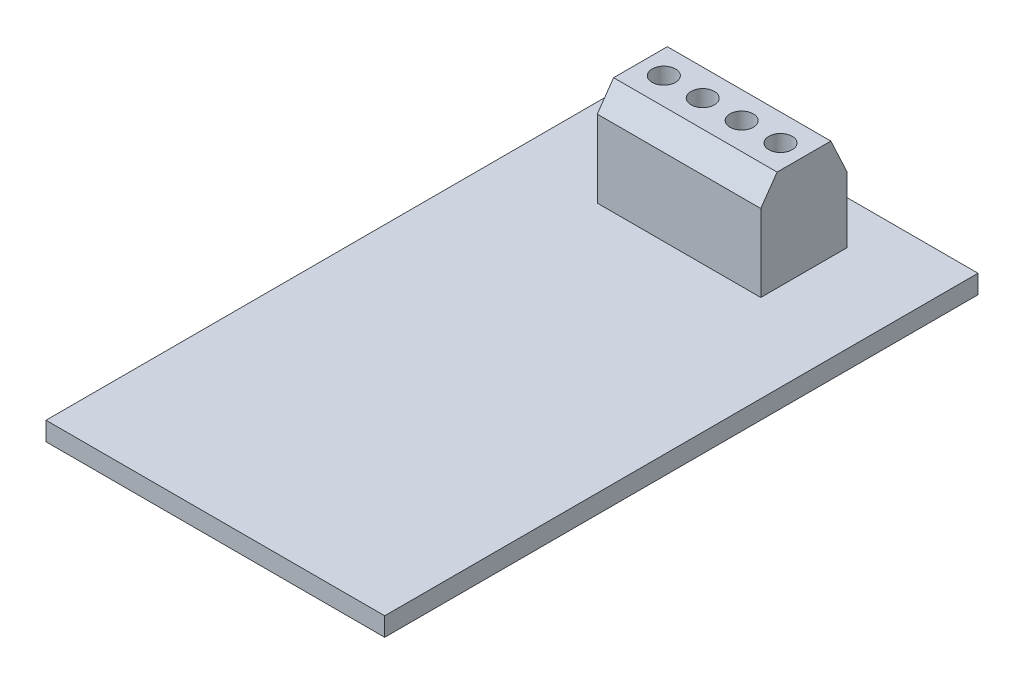
ISO-10303-21;
HEADER;
FILE_DESCRIPTION(('STEP AP214'),'2;1');
FILE_NAME('part.step','',(''),(''),'','','');
FILE_SCHEMA(('AUTOMOTIVE_DESIGN { 1 0 10303 214 1 1 1 1 }'));
ENDSEC;
DATA;
#1=APPLICATION_CONTEXT('core data for automotive mechanical design processes');
#2=APPLICATION_PROTOCOL_DEFINITION('international standard','automotive_design',2000,#1);
#3=PRODUCT_CONTEXT('',#1,'mechanical');
#4=PRODUCT('Part','Part','',(#3));
#5=PRODUCT_RELATED_PRODUCT_CATEGORY('part','',(#4));
#6=PRODUCT_DEFINITION_FORMATION('','',#4);
#7=PRODUCT_DEFINITION_CONTEXT('part definition',#1,'design');
#8=PRODUCT_DEFINITION('design','',#6,#7);
#9=PRODUCT_DEFINITION_SHAPE('','',#8);
#10=(LENGTH_UNIT() NAMED_UNIT(*) SI_UNIT(.MILLI.,.METRE.));
#11=(NAMED_UNIT(*) PLANE_ANGLE_UNIT() SI_UNIT($,.RADIAN.));
#12=(NAMED_UNIT(*) SI_UNIT($,.STERADIAN.) SOLID_ANGLE_UNIT());
#13=UNCERTAINTY_MEASURE_WITH_UNIT(LENGTH_MEASURE(1.E-05),#10,'distance_accuracy_value','');
#14=(GEOMETRIC_REPRESENTATION_CONTEXT(3) GLOBAL_UNCERTAINTY_ASSIGNED_CONTEXT((#13)) GLOBAL_UNIT_ASSIGNED_CONTEXT((#10,
#11,#12)) REPRESENTATION_CONTEXT('',''));
#15=CARTESIAN_POINT('',(0.,0.,0.));
#16=DIRECTION('',(0.,0.,1.));
#17=DIRECTION('',(1.,0.,0.));
#18=AXIS2_PLACEMENT_3D('',#15,#16,#17);
#19=CARTESIAN_POINT('',(0.,1.6,0.));
#20=DIRECTION('',(0.,1.,0.));
#21=DIRECTION('',(0.,0.,1.));
#22=AXIS2_PLACEMENT_3D('',#19,#20,#21);
#23=PLANE('',#22);
#24=DIRECTION('',(0.,0.,-1.));
#25=VECTOR('',#24,1.);
#26=CARTESIAN_POINT('',(14.5,1.6,-25.4));
#27=LINE('',#26,#25);
#28=CARTESIAN_POINT('',(14.5,1.6,25.4));
#29=VERTEX_POINT('',#28);
#30=CARTESIAN_POINT('',(14.5,1.6,-25.4));
#31=VERTEX_POINT('',#30);
#32=EDGE_CURVE('E169',#29,#31,#27,.T.);
#33=ORIENTED_EDGE('',*,*,#32,.T.);
#34=DIRECTION('',(-1.,0.,0.));
#35=VECTOR('',#34,1.);
#36=CARTESIAN_POINT('',(-14.5,1.6,-25.4));
#37=LINE('',#36,#35);
#38=CARTESIAN_POINT('',(-14.5,1.6,-25.4));
#39=VERTEX_POINT('',#38);
#40=EDGE_CURVE('E172',#31,#39,#37,.T.);
#41=ORIENTED_EDGE('',*,*,#40,.T.);
#42=DIRECTION('',(0.,0.,1.));
#43=VECTOR('',#42,1.);
#44=CARTESIAN_POINT('',(-14.5,1.6,-25.4));
#45=LINE('',#44,#43);
#46=CARTESIAN_POINT('',(-14.5,1.6,25.4));
#47=VERTEX_POINT('',#46);
#48=EDGE_CURVE('E175',#39,#47,#45,.T.);
#49=ORIENTED_EDGE('',*,*,#48,.T.);
#50=DIRECTION('',(1.,0.,0.));
#51=VECTOR('',#50,1.);
#52=CARTESIAN_POINT('',(-14.5,1.6,25.4));
#53=LINE('',#52,#51);
#54=EDGE_CURVE('E177',#47,#29,#53,.T.);
#55=ORIENTED_EDGE('',*,*,#54,.T.);
#56=EDGE_LOOP('',(#33,#41,#49,#55));
#57=FACE_BOUND('',#56,.T.);
#58=DIRECTION('',(-1.,0.,0.));
#59=VECTOR('',#58,1.);
#60=CARTESIAN_POINT('',(7.,1.6,-21.7));
#61=LINE('',#60,#59);
#62=CARTESIAN_POINT('',(7.,1.6,-21.7));
#63=VERTEX_POINT('',#62);
#64=CARTESIAN_POINT('',(-7.,1.6,-21.7));
#65=VERTEX_POINT('',#64);
#66=EDGE_CURVE('E54',#63,#65,#61,.T.);
#67=ORIENTED_EDGE('',*,*,#66,.F.);
#68=DIRECTION('',(0.,0.,-1.));
#69=VECTOR('',#68,1.);
#70=CARTESIAN_POINT('',(7.,1.6,-21.7));
#71=LINE('',#70,#69);
#72=CARTESIAN_POINT('',(7.,1.6,-14.3));
#73=VERTEX_POINT('',#72);
#74=EDGE_CURVE('E60',#73,#63,#71,.T.);
#75=ORIENTED_EDGE('',*,*,#74,.F.);
#76=DIRECTION('',(-1.,0.,0.));
#77=VECTOR('',#76,1.);
#78=CARTESIAN_POINT('',(7.,1.6,-14.3));
#79=LINE('',#78,#77);
#80=CARTESIAN_POINT('',(-7.,1.6,-14.3));
#81=VERTEX_POINT('',#80);
#82=EDGE_CURVE('E144',#73,#81,#79,.T.);
#83=ORIENTED_EDGE('',*,*,#82,.T.);
#84=DIRECTION('',(0.,0.,-1.));
#85=VECTOR('',#84,1.);
#86=CARTESIAN_POINT('',(-7.,1.6,-21.7));
#87=LINE('',#86,#85);
#88=EDGE_CURVE('E145',#81,#65,#87,.T.);
#89=ORIENTED_EDGE('',*,*,#88,.T.);
#90=EDGE_LOOP('',(#67,#75,#83,#89));
#91=FACE_BOUND('',#90,.T.);
#92=ADVANCED_FACE('F39',(#57,#91),#23,.T.);
#93=CARTESIAN_POINT('',(14.5,1.6,-25.4));
#94=DIRECTION('',(-1.,0.,0.));
#95=DIRECTION('',(0.,0.,1.));
#96=AXIS2_PLACEMENT_3D('',#93,#94,#95);
#97=PLANE('',#96);
#98=DIRECTION('',(0.,0.,-1.));
#99=VECTOR('',#98,1.);
#100=CARTESIAN_POINT('',(14.5,0.,-25.4));
#101=LINE('',#100,#99);
#102=CARTESIAN_POINT('',(14.5,0.,25.4));
#103=VERTEX_POINT('',#102);
#104=CARTESIAN_POINT('',(14.5,0.,-25.4));
#105=VERTEX_POINT('',#104);
#106=EDGE_CURVE('E168',#103,#105,#101,.T.);
#107=ORIENTED_EDGE('',*,*,#106,.T.);
#108=DIRECTION('',(0.,-1.,0.));
#109=VECTOR('',#108,1.);
#110=CARTESIAN_POINT('',(14.5,1.6,-25.4));
#111=LINE('',#110,#109);
#112=EDGE_CURVE('E11',#31,#105,#111,.T.);
#113=ORIENTED_EDGE('',*,*,#112,.F.);
#114=ORIENTED_EDGE('',*,*,#32,.F.);
#115=DIRECTION('',(0.,-1.,0.));
#116=VECTOR('',#115,1.);
#117=CARTESIAN_POINT('',(14.5,1.6,25.4));
#118=LINE('',#117,#116);
#119=EDGE_CURVE('E179',#29,#103,#118,.T.);
#120=ORIENTED_EDGE('',*,*,#119,.T.);
#121=EDGE_LOOP('',(#107,#113,#114,#120));
#122=FACE_BOUND('',#121,.T.);
#123=ADVANCED_FACE('F41',(#122),#97,.F.);
#124=CARTESIAN_POINT('',(-14.5,1.6,-25.4));
#125=DIRECTION('',(0.,0.,1.));
#126=DIRECTION('',(1.,0.,0.));
#127=AXIS2_PLACEMENT_3D('',#124,#125,#126);
#128=PLANE('',#127);
#129=DIRECTION('',(-1.,0.,0.));
#130=VECTOR('',#129,1.);
#131=CARTESIAN_POINT('',(-14.5,0.,-25.4));
#132=LINE('',#131,#130);
#133=CARTESIAN_POINT('',(-14.5,0.,-25.4));
#134=VERTEX_POINT('',#133);
#135=EDGE_CURVE('E182',#105,#134,#132,.T.);
#136=ORIENTED_EDGE('',*,*,#135,.T.);
#137=DIRECTION('',(0.,-1.,0.));
#138=VECTOR('',#137,1.);
#139=CARTESIAN_POINT('',(-14.5,1.6,-25.4));
#140=LINE('',#139,#138);
#141=EDGE_CURVE('E47',#39,#134,#140,.T.);
#142=ORIENTED_EDGE('',*,*,#141,.F.);
#143=ORIENTED_EDGE('',*,*,#40,.F.);
#144=ORIENTED_EDGE('',*,*,#112,.T.);
#145=EDGE_LOOP('',(#136,#142,#143,#144));
#146=FACE_BOUND('',#145,.T.);
#147=ADVANCED_FACE('F211',(#146),#128,.F.);
#148=CARTESIAN_POINT('',(-14.5,1.6,-25.4));
#149=DIRECTION('',(1.,0.,0.));
#150=DIRECTION('',(0.,0.,-1.));
#151=AXIS2_PLACEMENT_3D('',#148,#149,#150);
#152=PLANE('',#151);
#153=DIRECTION('',(0.,0.,1.));
#154=VECTOR('',#153,1.);
#155=CARTESIAN_POINT('',(-14.5,0.,-25.4));
#156=LINE('',#155,#154);
#157=CARTESIAN_POINT('',(-14.5,0.,25.4));
#158=VERTEX_POINT('',#157);
#159=EDGE_CURVE('E184',#134,#158,#156,.T.);
#160=ORIENTED_EDGE('',*,*,#159,.T.);
#161=DIRECTION('',(0.,-1.,0.));
#162=VECTOR('',#161,1.);
#163=CARTESIAN_POINT('',(-14.5,1.6,25.4));
#164=LINE('',#163,#162);
#165=EDGE_CURVE('E189',#47,#158,#164,.T.);
#166=ORIENTED_EDGE('',*,*,#165,.F.);
#167=ORIENTED_EDGE('',*,*,#48,.F.);
#168=ORIENTED_EDGE('',*,*,#141,.T.);
#169=EDGE_LOOP('',(#160,#166,#167,#168));
#170=FACE_BOUND('',#169,.T.);
#171=ADVANCED_FACE('F196',(#170),#152,.F.);
#172=CARTESIAN_POINT('',(-14.5,1.6,25.4));
#173=DIRECTION('',(0.,0.,-1.));
#174=DIRECTION('',(-1.,0.,0.));
#175=AXIS2_PLACEMENT_3D('',#172,#173,#174);
#176=PLANE('',#175);
#177=DIRECTION('',(1.,0.,0.));
#178=VECTOR('',#177,1.);
#179=CARTESIAN_POINT('',(-14.5,0.,25.4));
#180=LINE('',#179,#178);
#181=EDGE_CURVE('E173',#158,#103,#180,.T.);
#182=ORIENTED_EDGE('',*,*,#181,.T.);
#183=ORIENTED_EDGE('',*,*,#119,.F.);
#184=ORIENTED_EDGE('',*,*,#54,.F.);
#185=ORIENTED_EDGE('',*,*,#165,.T.);
#186=EDGE_LOOP('',(#182,#183,#184,#185));
#187=FACE_BOUND('',#186,.T.);
#188=ADVANCED_FACE('F205',(#187),#176,.F.);
#189=CARTESIAN_POINT('',(0.,0.,0.));
#190=DIRECTION('',(0.,1.,0.));
#191=DIRECTION('',(0.,0.,1.));
#192=AXIS2_PLACEMENT_3D('',#189,#190,#191);
#193=PLANE('',#192);
#194=ORIENTED_EDGE('',*,*,#106,.F.);
#195=ORIENTED_EDGE('',*,*,#181,.F.);
#196=ORIENTED_EDGE('',*,*,#159,.F.);
#197=ORIENTED_EDGE('',*,*,#135,.F.);
#198=EDGE_LOOP('',(#194,#195,#196,#197));
#199=FACE_BOUND('',#198,.T.);
#200=ADVANCED_FACE('F202',(#199),#193,.F.);
#201=CARTESIAN_POINT('',(7.,7.2,-21.7));
#202=DIRECTION('',(0.,0.,1.));
#203=DIRECTION('',(0.,-1.,0.));
#204=AXIS2_PLACEMENT_3D('',#201,#202,#203);
#205=PLANE('',#204);
#206=DIRECTION('',(0.,1.,0.));
#207=VECTOR('',#206,1.);
#208=CARTESIAN_POINT('',(-7.,7.2,-21.7));
#209=LINE('',#208,#207);
#210=CARTESIAN_POINT('',(-7.,7.2,-21.7));
#211=VERTEX_POINT('',#210);
#212=EDGE_CURVE('E126',#65,#211,#209,.T.);
#213=ORIENTED_EDGE('',*,*,#212,.T.);
#214=DIRECTION('',(-1.,0.,0.));
#215=VECTOR('',#214,1.);
#216=CARTESIAN_POINT('',(7.,7.2,-21.7));
#217=LINE('',#216,#215);
#218=CARTESIAN_POINT('',(7.,7.2,-21.7));
#219=VERTEX_POINT('',#218);
#220=EDGE_CURVE('E123',#219,#211,#217,.T.);
#221=ORIENTED_EDGE('',*,*,#220,.F.);
#222=DIRECTION('',(0.,1.,0.));
#223=VECTOR('',#222,1.);
#224=CARTESIAN_POINT('',(7.,7.2,-21.7));
#225=LINE('',#224,#223);
#226=EDGE_CURVE('E114',#63,#219,#225,.T.);
#227=ORIENTED_EDGE('',*,*,#226,.F.);
#228=ORIENTED_EDGE('',*,*,#66,.T.);
#229=EDGE_LOOP('',(#213,#221,#227,#228));
#230=FACE_BOUND('',#229,.T.);
#231=ADVANCED_FACE('F124',(#230),#205,.F.);
#232=CARTESIAN_POINT('',(7.,10.2,-20.3));
#233=DIRECTION('',(0.,-0.422885465331123,0.906183139995266));
#234=DIRECTION('',(0.,-0.906183139995266,-0.422885465331123));
#235=AXIS2_PLACEMENT_3D('',#232,#233,#234);
#236=PLANE('',#235);
#237=DIRECTION('',(0.,0.906183139995266,0.422885465331123));
#238=VECTOR('',#237,1.);
#239=CARTESIAN_POINT('',(-7.,10.2,-20.3));
#240=LINE('',#239,#238);
#241=CARTESIAN_POINT('',(-7.,10.2,-20.3));
#242=VERTEX_POINT('',#241);
#243=EDGE_CURVE('E149',#211,#242,#240,.T.);
#244=ORIENTED_EDGE('',*,*,#243,.T.);
#245=DIRECTION('',(-1.,0.,0.));
#246=VECTOR('',#245,1.);
#247=CARTESIAN_POINT('',(7.,10.2,-20.3));
#248=LINE('',#247,#246);
#249=CARTESIAN_POINT('',(7.,10.2,-20.3));
#250=VERTEX_POINT('',#249);
#251=EDGE_CURVE('E129',#250,#242,#248,.T.);
#252=ORIENTED_EDGE('',*,*,#251,.F.);
#253=DIRECTION('',(0.,0.906183139995266,0.422885465331123));
#254=VECTOR('',#253,1.);
#255=CARTESIAN_POINT('',(7.,10.2,-20.3));
#256=LINE('',#255,#254);
#257=EDGE_CURVE('E118',#219,#250,#256,.T.);
#258=ORIENTED_EDGE('',*,*,#257,.F.);
#259=ORIENTED_EDGE('',*,*,#220,.T.);
#260=EDGE_LOOP('',(#244,#252,#258,#259));
#261=FACE_BOUND('',#260,.T.);
#262=ADVANCED_FACE('F131',(#261),#236,.F.);
#263=CARTESIAN_POINT('',(7.,10.2,-15.7));
#264=DIRECTION('',(0.,-1.,0.));
#265=DIRECTION('',(0.,0.,-1.));
#266=AXIS2_PLACEMENT_3D('',#263,#264,#265);
#267=PLANE('',#266);
#268=CARTESIAN_POINT('',(-5.,10.2,-18.));
#269=DIRECTION('',(0.,1.,0.));
#270=DIRECTION('',(0.,0.,1.));
#271=AXIS2_PLACEMENT_3D('',#268,#269,#270);
#272=CIRCLE('',#271,1.);
#273=CARTESIAN_POINT('',(-5.,10.2,-17.));
#274=VERTEX_POINT('',#273);
#275=EDGE_CURVE('E407',#274,#274,#272,.T.);
#276=ORIENTED_EDGE('',*,*,#275,.F.);
#277=EDGE_LOOP('',(#276));
#278=FACE_BOUND('',#277,.T.);
#279=CARTESIAN_POINT('',(-1.67,10.2,-18.));
#280=DIRECTION('',(0.,1.,0.));
#281=DIRECTION('',(0.,0.,1.));
#282=AXIS2_PLACEMENT_3D('',#279,#280,#281);
#283=CIRCLE('',#282,1.);
#284=CARTESIAN_POINT('',(-1.67,10.2,-17.));
#285=VERTEX_POINT('',#284);
#286=EDGE_CURVE('E415',#285,#285,#283,.T.);
#287=ORIENTED_EDGE('',*,*,#286,.F.);
#288=EDGE_LOOP('',(#287));
#289=FACE_BOUND('',#288,.T.);
#290=CARTESIAN_POINT('',(1.66,10.2,-18.));
#291=DIRECTION('',(0.,1.,0.));
#292=DIRECTION('',(0.,0.,1.));
#293=AXIS2_PLACEMENT_3D('',#290,#291,#292);
#294=CIRCLE('',#293,1.);
#295=CARTESIAN_POINT('',(1.66,10.2,-17.));
#296=VERTEX_POINT('',#295);
#297=EDGE_CURVE('E421',#296,#296,#294,.T.);
#298=ORIENTED_EDGE('',*,*,#297,.F.);
#299=EDGE_LOOP('',(#298));
#300=FACE_BOUND('',#299,.T.);
#301=CARTESIAN_POINT('',(4.99,10.2,-18.));
#302=DIRECTION('',(0.,1.,0.));
#303=DIRECTION('',(0.,0.,1.));
#304=AXIS2_PLACEMENT_3D('',#301,#302,#303);
#305=CIRCLE('',#304,1.);
#306=CARTESIAN_POINT('',(4.99,10.2,-17.));
#307=VERTEX_POINT('',#306);
#308=EDGE_CURVE('E427',#307,#307,#305,.T.);
#309=ORIENTED_EDGE('',*,*,#308,.F.);
#310=EDGE_LOOP('',(#309));
#311=FACE_BOUND('',#310,.T.);
#312=DIRECTION('',(0.,0.,1.));
#313=VECTOR('',#312,1.);
#314=CARTESIAN_POINT('',(-7.,10.2,-15.7));
#315=LINE('',#314,#313);
#316=CARTESIAN_POINT('',(-7.,10.2,-15.7));
#317=VERTEX_POINT('',#316);
#318=EDGE_CURVE('E151',#242,#317,#315,.T.);
#319=ORIENTED_EDGE('',*,*,#318,.T.);
#320=DIRECTION('',(-1.,0.,0.));
#321=VECTOR('',#320,1.);
#322=CARTESIAN_POINT('',(7.,10.2,-15.7));
#323=LINE('',#322,#321);
#324=CARTESIAN_POINT('',(7.,10.2,-15.7));
#325=VERTEX_POINT('',#324);
#326=EDGE_CURVE('E163',#325,#317,#323,.T.);
#327=ORIENTED_EDGE('',*,*,#326,.F.);
#328=DIRECTION('',(0.,0.,1.));
#329=VECTOR('',#328,1.);
#330=CARTESIAN_POINT('',(7.,10.2,-15.7));
#331=LINE('',#330,#329);
#332=EDGE_CURVE('E134',#250,#325,#331,.T.);
#333=ORIENTED_EDGE('',*,*,#332,.F.);
#334=ORIENTED_EDGE('',*,*,#251,.T.);
#335=EDGE_LOOP('',(#319,#327,#333,#334));
#336=FACE_BOUND('',#335,.T.);
#337=ADVANCED_FACE('F248',(#278,#289,#300,#311,#336),#267,.F.);
#338=CARTESIAN_POINT('',(7.,8.2,-14.3));
#339=DIRECTION('',(0.,-0.573462344363329,-0.81923192051904));
#340=DIRECTION('',(0.,0.81923192051904,-0.57346234436333));
#341=AXIS2_PLACEMENT_3D('',#338,#339,#340);
#342=PLANE('',#341);
#343=DIRECTION('',(0.,-0.81923192051904,0.573462344363329));
#344=VECTOR('',#343,1.);
#345=CARTESIAN_POINT('',(-7.,8.2,-14.3));
#346=LINE('',#345,#344);
#347=CARTESIAN_POINT('',(-7.,8.2,-14.3));
#348=VERTEX_POINT('',#347);
#349=EDGE_CURVE('E153',#317,#348,#346,.T.);
#350=ORIENTED_EDGE('',*,*,#349,.T.);
#351=DIRECTION('',(-1.,0.,0.));
#352=VECTOR('',#351,1.);
#353=CARTESIAN_POINT('',(7.,8.2,-14.3));
#354=LINE('',#353,#352);
#355=CARTESIAN_POINT('',(7.,8.2,-14.3));
#356=VERTEX_POINT('',#355);
#357=EDGE_CURVE('E160',#356,#348,#354,.T.);
#358=ORIENTED_EDGE('',*,*,#357,.F.);
#359=DIRECTION('',(0.,-0.81923192051904,0.573462344363329));
#360=VECTOR('',#359,1.);
#361=CARTESIAN_POINT('',(7.,8.2,-14.3));
#362=LINE('',#361,#360);
#363=EDGE_CURVE('E136',#325,#356,#362,.T.);
#364=ORIENTED_EDGE('',*,*,#363,.F.);
#365=ORIENTED_EDGE('',*,*,#326,.T.);
#366=EDGE_LOOP('',(#350,#358,#364,#365));
#367=FACE_BOUND('',#366,.T.);
#368=ADVANCED_FACE('F255',(#367),#342,.F.);
#369=CARTESIAN_POINT('',(7.,1.6,-14.3));
#370=DIRECTION('',(0.,0.,-1.));
#371=DIRECTION('',(-1.,0.,0.));
#372=AXIS2_PLACEMENT_3D('',#369,#370,#371);
#373=PLANE('',#372);
#374=DIRECTION('',(0.,-1.,0.));
#375=VECTOR('',#374,1.);
#376=CARTESIAN_POINT('',(-7.,1.6,-14.3));
#377=LINE('',#376,#375);
#378=EDGE_CURVE('E155',#348,#81,#377,.T.);
#379=ORIENTED_EDGE('',*,*,#378,.T.);
#380=ORIENTED_EDGE('',*,*,#82,.F.);
#381=DIRECTION('',(0.,-1.,0.));
#382=VECTOR('',#381,1.);
#383=CARTESIAN_POINT('',(7.,1.6,-14.3));
#384=LINE('',#383,#382);
#385=EDGE_CURVE('E141',#356,#73,#384,.T.);
#386=ORIENTED_EDGE('',*,*,#385,.F.);
#387=ORIENTED_EDGE('',*,*,#357,.T.);
#388=EDGE_LOOP('',(#379,#380,#386,#387));
#389=FACE_BOUND('',#388,.T.);
#390=ADVANCED_FACE('F264',(#389),#373,.F.);
#391=CARTESIAN_POINT('',(7.,0.,0.));
#392=DIRECTION('',(-1.,0.,0.));
#393=DIRECTION('',(0.,0.,1.));
#394=AXIS2_PLACEMENT_3D('',#391,#392,#393);
#395=PLANE('',#394);
#396=ORIENTED_EDGE('',*,*,#74,.T.);
#397=ORIENTED_EDGE('',*,*,#226,.T.);
#398=ORIENTED_EDGE('',*,*,#257,.T.);
#399=ORIENTED_EDGE('',*,*,#332,.T.);
#400=ORIENTED_EDGE('',*,*,#363,.T.);
#401=ORIENTED_EDGE('',*,*,#385,.T.);
#402=EDGE_LOOP('',(#396,#397,#398,#399,#400,#401));
#403=FACE_BOUND('',#402,.T.);
#404=ADVANCED_FACE('F116',(#403),#395,.F.);
#405=CARTESIAN_POINT('',(-7.,0.,0.));
#406=DIRECTION('',(-1.,0.,0.));
#407=DIRECTION('',(0.,0.,1.));
#408=AXIS2_PLACEMENT_3D('',#405,#406,#407);
#409=PLANE('',#408);
#410=ORIENTED_EDGE('',*,*,#88,.F.);
#411=ORIENTED_EDGE('',*,*,#378,.F.);
#412=ORIENTED_EDGE('',*,*,#349,.F.);
#413=ORIENTED_EDGE('',*,*,#318,.F.);
#414=ORIENTED_EDGE('',*,*,#243,.F.);
#415=ORIENTED_EDGE('',*,*,#212,.F.);
#416=EDGE_LOOP('',(#410,#411,#412,#413,#414,#415));
#417=FACE_BOUND('',#416,.T.);
#418=ADVANCED_FACE('F276',(#417),#409,.T.);
#419=CARTESIAN_POINT('',(4.99,7.2,-18.));
#420=DIRECTION('',(0.,1.,0.));
#421=DIRECTION('',(0.,0.,1.));
#422=AXIS2_PLACEMENT_3D('',#419,#420,#421);
#423=CYLINDRICAL_SURFACE('',#422,1.);
#424=CARTESIAN_POINT('',(4.99,7.2,-18.));
#425=DIRECTION('',(0.,1.,0.));
#426=DIRECTION('',(0.,0.,1.));
#427=AXIS2_PLACEMENT_3D('',#424,#425,#426);
#428=CIRCLE('',#427,1.);
#429=CARTESIAN_POINT('',(4.99,7.2,-17.));
#430=VERTEX_POINT('',#429);
#431=EDGE_CURVE('E424',#430,#430,#428,.T.);
#432=ORIENTED_EDGE('',*,*,#431,.F.);
#433=EDGE_LOOP('',(#432));
#434=FACE_BOUND('',#433,.T.);
#435=ORIENTED_EDGE('',*,*,#308,.T.);
#436=EDGE_LOOP('',(#435));
#437=FACE_BOUND('',#436,.T.);
#438=ADVANCED_FACE('F281',(#434,#437),#423,.F.);
#439=CARTESIAN_POINT('',(4.99,7.2,-18.));
#440=DIRECTION('',(0.,1.,0.));
#441=DIRECTION('',(0.,0.,1.));
#442=AXIS2_PLACEMENT_3D('',#439,#440,#441);
#443=PLANE('',#442);
#444=ORIENTED_EDGE('',*,*,#431,.T.);
#445=EDGE_LOOP('',(#444));
#446=FACE_BOUND('',#445,.T.);
#447=ADVANCED_FACE('F288',(#446),#443,.T.);
#448=CARTESIAN_POINT('',(1.66,7.2,-18.));
#449=DIRECTION('',(0.,1.,0.));
#450=DIRECTION('',(0.,0.,1.));
#451=AXIS2_PLACEMENT_3D('',#448,#449,#450);
#452=CYLINDRICAL_SURFACE('',#451,1.);
#453=CARTESIAN_POINT('',(1.66,7.2,-18.));
#454=DIRECTION('',(0.,1.,0.));
#455=DIRECTION('',(0.,0.,1.));
#456=AXIS2_PLACEMENT_3D('',#453,#454,#455);
#457=CIRCLE('',#456,1.);
#458=CARTESIAN_POINT('',(1.66,7.2,-17.));
#459=VERTEX_POINT('',#458);
#460=EDGE_CURVE('E418',#459,#459,#457,.T.);
#461=ORIENTED_EDGE('',*,*,#460,.F.);
#462=EDGE_LOOP('',(#461));
#463=FACE_BOUND('',#462,.T.);
#464=ORIENTED_EDGE('',*,*,#297,.T.);
#465=EDGE_LOOP('',(#464));
#466=FACE_BOUND('',#465,.T.);
#467=ADVANCED_FACE('F296',(#463,#466),#452,.F.);
#468=CARTESIAN_POINT('',(1.66,7.2,-18.));
#469=DIRECTION('',(0.,1.,0.));
#470=DIRECTION('',(0.,0.,1.));
#471=AXIS2_PLACEMENT_3D('',#468,#469,#470);
#472=PLANE('',#471);
#473=ORIENTED_EDGE('',*,*,#460,.T.);
#474=EDGE_LOOP('',(#473));
#475=FACE_BOUND('',#474,.T.);
#476=ADVANCED_FACE('F304',(#475),#472,.T.);
#477=CARTESIAN_POINT('',(-1.67,7.2,-18.));
#478=DIRECTION('',(0.,1.,0.));
#479=DIRECTION('',(0.,0.,1.));
#480=AXIS2_PLACEMENT_3D('',#477,#478,#479);
#481=CYLINDRICAL_SURFACE('',#480,1.);
#482=CARTESIAN_POINT('',(-1.67,7.2,-18.));
#483=DIRECTION('',(0.,1.,0.));
#484=DIRECTION('',(0.,0.,1.));
#485=AXIS2_PLACEMENT_3D('',#482,#483,#484);
#486=CIRCLE('',#485,1.);
#487=CARTESIAN_POINT('',(-1.67,7.2,-17.));
#488=VERTEX_POINT('',#487);
#489=EDGE_CURVE('E410',#488,#488,#486,.T.);
#490=ORIENTED_EDGE('',*,*,#489,.F.);
#491=EDGE_LOOP('',(#490));
#492=FACE_BOUND('',#491,.T.);
#493=ORIENTED_EDGE('',*,*,#286,.T.);
#494=EDGE_LOOP('',(#493));
#495=FACE_BOUND('',#494,.T.);
#496=ADVANCED_FACE('F312',(#492,#495),#481,.F.);
#497=CARTESIAN_POINT('',(-1.67,7.2,-18.));
#498=DIRECTION('',(0.,1.,0.));
#499=DIRECTION('',(0.,0.,1.));
#500=AXIS2_PLACEMENT_3D('',#497,#498,#499);
#501=PLANE('',#500);
#502=ORIENTED_EDGE('',*,*,#489,.T.);
#503=EDGE_LOOP('',(#502));
#504=FACE_BOUND('',#503,.T.);
#505=ADVANCED_FACE('F320',(#504),#501,.T.);
#506=CARTESIAN_POINT('',(-5.,7.2,-18.));
#507=DIRECTION('',(0.,1.,0.));
#508=DIRECTION('',(0.,0.,1.));
#509=AXIS2_PLACEMENT_3D('',#506,#507,#508);
#510=CYLINDRICAL_SURFACE('',#509,1.);
#511=CARTESIAN_POINT('',(-5.,7.2,-18.));
#512=DIRECTION('',(0.,1.,0.));
#513=DIRECTION('',(0.,0.,1.));
#514=AXIS2_PLACEMENT_3D('',#511,#512,#513);
#515=CIRCLE('',#514,1.);
#516=CARTESIAN_POINT('',(-5.,7.2,-17.));
#517=VERTEX_POINT('',#516);
#518=EDGE_CURVE('E147',#517,#517,#515,.T.);
#519=ORIENTED_EDGE('',*,*,#518,.F.);
#520=EDGE_LOOP('',(#519));
#521=FACE_BOUND('',#520,.T.);
#522=ORIENTED_EDGE('',*,*,#275,.T.);
#523=EDGE_LOOP('',(#522));
#524=FACE_BOUND('',#523,.T.);
#525=ADVANCED_FACE('F328',(#521,#524),#510,.F.);
#526=CARTESIAN_POINT('',(-5.,7.2,-18.));
#527=DIRECTION('',(0.,1.,0.));
#528=DIRECTION('',(0.,0.,1.));
#529=AXIS2_PLACEMENT_3D('',#526,#527,#528);
#530=PLANE('',#529);
#531=ORIENTED_EDGE('',*,*,#518,.T.);
#532=EDGE_LOOP('',(#531));
#533=FACE_BOUND('',#532,.T.);
#534=ADVANCED_FACE('F336',(#533),#530,.T.);
#535=CLOSED_SHELL('',(#92,#123,#147,#171,#188,#200,#231,#262,#337,#368,#390,#404,#418,#438,#447,
#467,#476,#496,#505,#525,#534));
#536=MANIFOLD_SOLID_BREP('B2',#535);
#537=ADVANCED_BREP_SHAPE_REPRESENTATION('',(#18,#536),#14);
#538=SHAPE_DEFINITION_REPRESENTATION(#9,#537);
ENDSEC;
END-ISO-10303-21;
